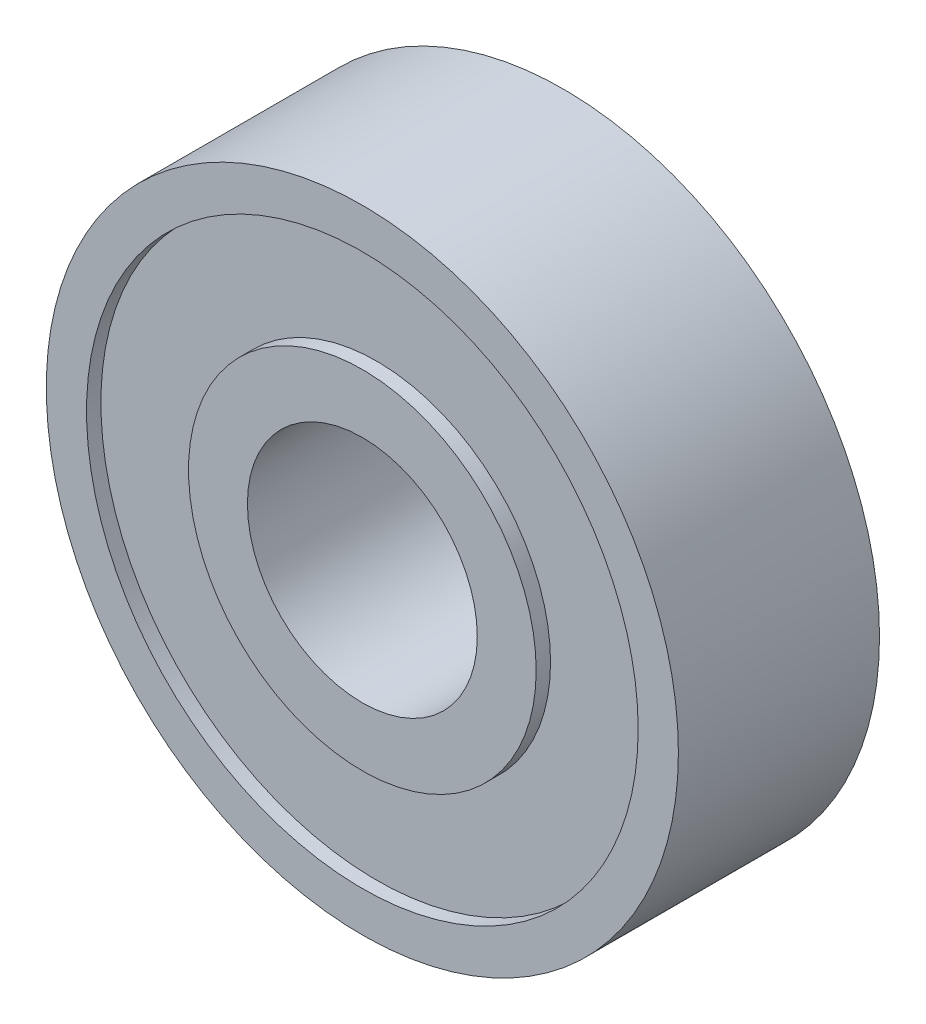
ISO-10303-21;
HEADER;
FILE_DESCRIPTION(('STEP AP214'),'2;1');
FILE_NAME('part.step','',(''),(''),'','','');
FILE_SCHEMA(('AUTOMOTIVE_DESIGN { 1 0 10303 214 1 1 1 1 }'));
ENDSEC;
DATA;
#1=APPLICATION_CONTEXT('core data for automotive mechanical design processes');
#2=APPLICATION_PROTOCOL_DEFINITION('international standard','automotive_design',2000,#1);
#3=PRODUCT_CONTEXT('',#1,'mechanical');
#4=PRODUCT('Part','Part','',(#3));
#5=PRODUCT_RELATED_PRODUCT_CATEGORY('part','',(#4));
#6=PRODUCT_DEFINITION_FORMATION('','',#4);
#7=PRODUCT_DEFINITION_CONTEXT('part definition',#1,'design');
#8=PRODUCT_DEFINITION('design','',#6,#7);
#9=PRODUCT_DEFINITION_SHAPE('','',#8);
#10=(LENGTH_UNIT() NAMED_UNIT(*) SI_UNIT(.MILLI.,.METRE.));
#11=(NAMED_UNIT(*) PLANE_ANGLE_UNIT() SI_UNIT($,.RADIAN.));
#12=(NAMED_UNIT(*) SI_UNIT($,.STERADIAN.) SOLID_ANGLE_UNIT());
#13=UNCERTAINTY_MEASURE_WITH_UNIT(LENGTH_MEASURE(1.E-05),#10,'distance_accuracy_value','');
#14=(GEOMETRIC_REPRESENTATION_CONTEXT(3) GLOBAL_UNCERTAINTY_ASSIGNED_CONTEXT((#13)) GLOBAL_UNIT_ASSIGNED_CONTEXT((#10,
#11,#12)) REPRESENTATION_CONTEXT('',''));
#15=CARTESIAN_POINT('',(0.,0.,0.));
#16=DIRECTION('',(0.,0.,1.));
#17=DIRECTION('',(1.,0.,0.));
#18=AXIS2_PLACEMENT_3D('',#15,#16,#17);
#19=CARTESIAN_POINT('',(0.,0.,-3.5));
#20=DIRECTION('',(0.,0.,1.));
#21=DIRECTION('',(1.,0.,0.));
#22=AXIS2_PLACEMENT_3D('',#19,#20,#21);
#23=PLANE('',#22);
#24=CARTESIAN_POINT('',(0.,0.,-3.5));
#25=DIRECTION('',(0.,0.,1.));
#26=DIRECTION('',(1.,0.,0.));
#27=AXIS2_PLACEMENT_3D('',#24,#25,#26);
#28=CIRCLE('',#27,4.);
#29=CARTESIAN_POINT('',(4.,0.,-3.5));
#30=VERTEX_POINT('',#29);
#31=EDGE_CURVE('E41',#30,#30,#28,.T.);
#32=ORIENTED_EDGE('',*,*,#31,.T.);
#33=EDGE_LOOP('',(#32));
#34=FACE_BOUND('',#33,.T.);
#35=CARTESIAN_POINT('',(0.,0.,-3.5));
#36=DIRECTION('',(0.,0.,1.));
#37=DIRECTION('',(1.,0.,0.));
#38=AXIS2_PLACEMENT_3D('',#35,#36,#37);
#39=CIRCLE('',#38,6.05);
#40=CARTESIAN_POINT('',(6.05,0.,-3.5));
#41=VERTEX_POINT('',#40);
#42=EDGE_CURVE('E67',#41,#41,#39,.T.);
#43=ORIENTED_EDGE('',*,*,#42,.F.);
#44=EDGE_LOOP('',(#43));
#45=FACE_BOUND('',#44,.T.);
#46=ADVANCED_FACE('F30',(#34,#45),#23,.F.);
#47=CARTESIAN_POINT('',(0.,0.,3.5));
#48=DIRECTION('',(0.,0.,1.));
#49=DIRECTION('',(1.,0.,0.));
#50=AXIS2_PLACEMENT_3D('',#47,#48,#49);
#51=PLANE('',#50);
#52=CARTESIAN_POINT('',(0.,0.,3.5));
#53=DIRECTION('',(0.,0.,1.));
#54=DIRECTION('',(1.,0.,0.));
#55=AXIS2_PLACEMENT_3D('',#52,#53,#54);
#56=CIRCLE('',#55,4.);
#57=CARTESIAN_POINT('',(4.,0.,3.5));
#58=VERTEX_POINT('',#57);
#59=EDGE_CURVE('E43',#58,#58,#56,.T.);
#60=ORIENTED_EDGE('',*,*,#59,.F.);
#61=EDGE_LOOP('',(#60));
#62=FACE_BOUND('',#61,.T.);
#63=CARTESIAN_POINT('',(0.,0.,3.5));
#64=DIRECTION('',(0.,0.,1.));
#65=DIRECTION('',(1.,0.,0.));
#66=AXIS2_PLACEMENT_3D('',#63,#64,#65);
#67=CIRCLE('',#66,6.05);
#68=CARTESIAN_POINT('',(6.05,0.,3.5));
#69=VERTEX_POINT('',#68);
#70=EDGE_CURVE('E55',#69,#69,#67,.T.);
#71=ORIENTED_EDGE('',*,*,#70,.T.);
#72=EDGE_LOOP('',(#71));
#73=FACE_BOUND('',#72,.T.);
#74=ADVANCED_FACE('F83',(#62,#73),#51,.T.);
#75=CARTESIAN_POINT('',(0.,0.,3.5));
#76=DIRECTION('',(0.,0.,-1.));
#77=DIRECTION('',(-1.,0.,0.));
#78=AXIS2_PLACEMENT_3D('',#75,#76,#77);
#79=CYLINDRICAL_SURFACE('',#78,11.);
#80=CARTESIAN_POINT('',(0.,0.,3.5));
#81=DIRECTION('',(0.,0.,1.));
#82=DIRECTION('',(1.,0.,0.));
#83=AXIS2_PLACEMENT_3D('',#80,#81,#82);
#84=CIRCLE('',#83,11.);
#85=CARTESIAN_POINT('',(11.,0.,3.5));
#86=VERTEX_POINT('',#85);
#87=EDGE_CURVE('E10',#86,#86,#84,.T.);
#88=ORIENTED_EDGE('',*,*,#87,.F.);
#89=EDGE_LOOP('',(#88));
#90=FACE_BOUND('',#89,.T.);
#91=CARTESIAN_POINT('',(0.,0.,-3.5));
#92=DIRECTION('',(0.,0.,1.));
#93=DIRECTION('',(1.,0.,0.));
#94=AXIS2_PLACEMENT_3D('',#91,#92,#93);
#95=CIRCLE('',#94,11.);
#96=CARTESIAN_POINT('',(11.,0.,-3.5));
#97=VERTEX_POINT('',#96);
#98=EDGE_CURVE('E34',#97,#97,#95,.T.);
#99=ORIENTED_EDGE('',*,*,#98,.T.);
#100=EDGE_LOOP('',(#99));
#101=FACE_BOUND('',#100,.T.);
#102=ADVANCED_FACE('F32',(#90,#101),#79,.T.);
#103=CARTESIAN_POINT('',(0.,0.,3.5));
#104=DIRECTION('',(0.,0.,1.));
#105=DIRECTION('',(1.,0.,0.));
#106=AXIS2_PLACEMENT_3D('',#103,#104,#105);
#107=CIRCLE('',#106,9.6);
#108=CARTESIAN_POINT('',(9.6,0.,3.5));
#109=VERTEX_POINT('',#108);
#110=EDGE_CURVE('E49',#109,#109,#107,.T.);
#111=ORIENTED_EDGE('',*,*,#110,.F.);
#112=EDGE_LOOP('',(#111));
#113=FACE_BOUND('',#112,.T.);
#114=ORIENTED_EDGE('',*,*,#87,.T.);
#115=EDGE_LOOP('',(#114));
#116=FACE_BOUND('',#115,.T.);
#117=ADVANCED_FACE('F91',(#113,#116),#51,.T.);
#118=CARTESIAN_POINT('',(0.,0.,-3.5));
#119=DIRECTION('',(0.,0.,1.));
#120=DIRECTION('',(1.,0.,0.));
#121=AXIS2_PLACEMENT_3D('',#118,#119,#120);
#122=CIRCLE('',#121,9.6);
#123=CARTESIAN_POINT('',(9.6,0.,-3.5));
#124=VERTEX_POINT('',#123);
#125=EDGE_CURVE('E61',#124,#124,#122,.T.);
#126=ORIENTED_EDGE('',*,*,#125,.T.);
#127=EDGE_LOOP('',(#126));
#128=FACE_BOUND('',#127,.T.);
#129=ORIENTED_EDGE('',*,*,#98,.F.);
#130=EDGE_LOOP('',(#129));
#131=FACE_BOUND('',#130,.T.);
#132=ADVANCED_FACE('F85',(#128,#131),#23,.F.);
#133=CARTESIAN_POINT('',(0.,0.,-3.5));
#134=DIRECTION('',(0.,0.,1.));
#135=DIRECTION('',(1.,0.,0.));
#136=AXIS2_PLACEMENT_3D('',#133,#134,#135);
#137=CYLINDRICAL_SURFACE('',#136,4.);
#138=ORIENTED_EDGE('',*,*,#31,.F.);
#139=EDGE_LOOP('',(#138));
#140=FACE_BOUND('',#139,.T.);
#141=ORIENTED_EDGE('',*,*,#59,.T.);
#142=EDGE_LOOP('',(#141));
#143=FACE_BOUND('',#142,.T.);
#144=ADVANCED_FACE('F93',(#140,#143),#137,.F.);
#145=CARTESIAN_POINT('',(0.,0.,3.));
#146=DIRECTION('',(0.,0.,1.));
#147=DIRECTION('',(1.,0.,0.));
#148=AXIS2_PLACEMENT_3D('',#145,#146,#147);
#149=CYLINDRICAL_SURFACE('',#148,9.6);
#150=CARTESIAN_POINT('',(0.,0.,3.));
#151=DIRECTION('',(0.,0.,1.));
#152=DIRECTION('',(1.,0.,0.));
#153=AXIS2_PLACEMENT_3D('',#150,#151,#152);
#154=CIRCLE('',#153,9.6);
#155=CARTESIAN_POINT('',(9.6,0.,3.));
#156=VERTEX_POINT('',#155);
#157=EDGE_CURVE('E46',#156,#156,#154,.T.);
#158=ORIENTED_EDGE('',*,*,#157,.F.);
#159=EDGE_LOOP('',(#158));
#160=FACE_BOUND('',#159,.T.);
#161=ORIENTED_EDGE('',*,*,#110,.T.);
#162=EDGE_LOOP('',(#161));
#163=FACE_BOUND('',#162,.T.);
#164=ADVANCED_FACE('F99',(#160,#163),#149,.F.);
#165=CARTESIAN_POINT('',(0.,0.,3.));
#166=DIRECTION('',(0.,0.,1.));
#167=DIRECTION('',(1.,0.,0.));
#168=AXIS2_PLACEMENT_3D('',#165,#166,#167);
#169=PLANE('',#168);
#170=CARTESIAN_POINT('',(0.,0.,3.));
#171=DIRECTION('',(0.,0.,1.));
#172=DIRECTION('',(1.,0.,0.));
#173=AXIS2_PLACEMENT_3D('',#170,#171,#172);
#174=CIRCLE('',#173,6.05);
#175=CARTESIAN_POINT('',(6.05,0.,3.));
#176=VERTEX_POINT('',#175);
#177=EDGE_CURVE('E52',#176,#176,#174,.T.);
#178=ORIENTED_EDGE('',*,*,#177,.F.);
#179=EDGE_LOOP('',(#178));
#180=FACE_BOUND('',#179,.T.);
#181=ORIENTED_EDGE('',*,*,#157,.T.);
#182=EDGE_LOOP('',(#181));
#183=FACE_BOUND('',#182,.T.);
#184=ADVANCED_FACE('F130',(#180,#183),#169,.T.);
#185=CARTESIAN_POINT('',(0.,0.,3.));
#186=DIRECTION('',(0.,0.,1.));
#187=DIRECTION('',(1.,0.,0.));
#188=AXIS2_PLACEMENT_3D('',#185,#186,#187);
#189=CYLINDRICAL_SURFACE('',#188,6.05);
#190=ORIENTED_EDGE('',*,*,#177,.T.);
#191=EDGE_LOOP('',(#190));
#192=FACE_BOUND('',#191,.T.);
#193=ORIENTED_EDGE('',*,*,#70,.F.);
#194=EDGE_LOOP('',(#193));
#195=FACE_BOUND('',#194,.T.);
#196=ADVANCED_FACE('F140',(#192,#195),#189,.T.);
#197=CARTESIAN_POINT('',(0.,0.,-3.));
#198=DIRECTION('',(0.,0.,-1.));
#199=DIRECTION('',(1.,0.,0.));
#200=AXIS2_PLACEMENT_3D('',#197,#198,#199);
#201=PLANE('',#200);
#202=CARTESIAN_POINT('',(0.,0.,-3.));
#203=DIRECTION('',(0.,0.,1.));
#204=DIRECTION('',(1.,0.,0.));
#205=AXIS2_PLACEMENT_3D('',#202,#203,#204);
#206=CIRCLE('',#205,9.6);
#207=CARTESIAN_POINT('',(9.6,0.,-3.));
#208=VERTEX_POINT('',#207);
#209=EDGE_CURVE('E58',#208,#208,#206,.T.);
#210=ORIENTED_EDGE('',*,*,#209,.F.);
#211=EDGE_LOOP('',(#210));
#212=FACE_BOUND('',#211,.T.);
#213=CARTESIAN_POINT('',(0.,0.,-3.));
#214=DIRECTION('',(0.,0.,1.));
#215=DIRECTION('',(1.,0.,0.));
#216=AXIS2_PLACEMENT_3D('',#213,#214,#215);
#217=CIRCLE('',#216,6.05);
#218=CARTESIAN_POINT('',(6.05,0.,-3.));
#219=VERTEX_POINT('',#218);
#220=EDGE_CURVE('E64',#219,#219,#217,.T.);
#221=ORIENTED_EDGE('',*,*,#220,.T.);
#222=EDGE_LOOP('',(#221));
#223=FACE_BOUND('',#222,.T.);
#224=ADVANCED_FACE('F73',(#212,#223),#201,.T.);
#225=CARTESIAN_POINT('',(0.,0.,-3.));
#226=DIRECTION('',(0.,0.,-1.));
#227=DIRECTION('',(-1.,0.,0.));
#228=AXIS2_PLACEMENT_3D('',#225,#226,#227);
#229=CYLINDRICAL_SURFACE('',#228,9.6);
#230=ORIENTED_EDGE('',*,*,#209,.T.);
#231=EDGE_LOOP('',(#230));
#232=FACE_BOUND('',#231,.T.);
#233=ORIENTED_EDGE('',*,*,#125,.F.);
#234=EDGE_LOOP('',(#233));
#235=FACE_BOUND('',#234,.T.);
#236=ADVANCED_FACE('F78',(#232,#235),#229,.F.);
#237=CARTESIAN_POINT('',(0.,0.,-3.));
#238=DIRECTION('',(0.,0.,-1.));
#239=DIRECTION('',(-1.,0.,0.));
#240=AXIS2_PLACEMENT_3D('',#237,#238,#239);
#241=CYLINDRICAL_SURFACE('',#240,6.05);
#242=ORIENTED_EDGE('',*,*,#220,.F.);
#243=EDGE_LOOP('',(#242));
#244=FACE_BOUND('',#243,.T.);
#245=ORIENTED_EDGE('',*,*,#42,.T.);
#246=EDGE_LOOP('',(#245));
#247=FACE_BOUND('',#246,.T.);
#248=ADVANCED_FACE('F75',(#244,#247),#241,.T.);
#249=CLOSED_SHELL('',(#46,#74,#102,#117,#132,#144,#164,#184,#196,#224,#236,#248));
#250=MANIFOLD_SOLID_BREP('B2',#249);
#251=ADVANCED_BREP_SHAPE_REPRESENTATION('',(#18,#250),#14);
#252=SHAPE_DEFINITION_REPRESENTATION(#9,#251);
ENDSEC;
END-ISO-10303-21;
